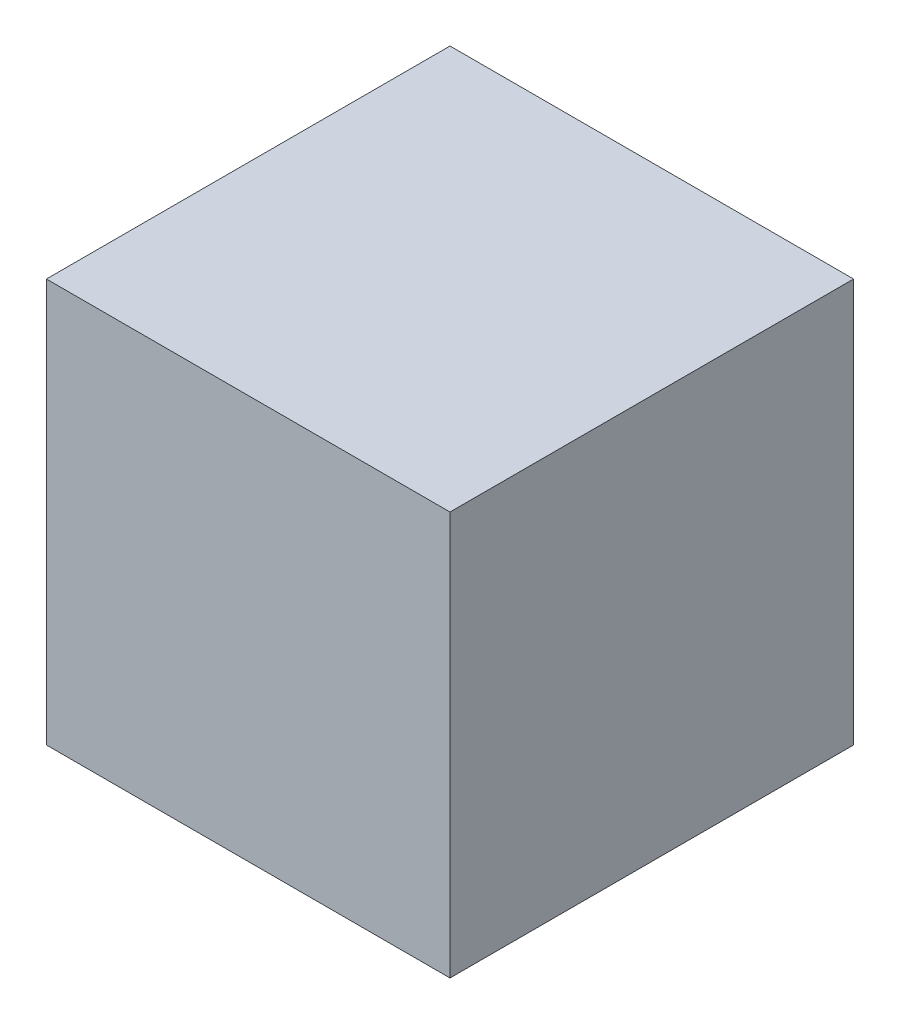
ISO-10303-21;
HEADER;
FILE_DESCRIPTION(('STEP AP214'),'2;1');
FILE_NAME('part.step','',(''),(''),'','','');
FILE_SCHEMA(('AUTOMOTIVE_DESIGN { 1 0 10303 214 1 1 1 1 }'));
ENDSEC;
DATA;
#1=APPLICATION_CONTEXT('core data for automotive mechanical design processes');
#2=APPLICATION_PROTOCOL_DEFINITION('international standard','automotive_design',2000,#1);
#3=PRODUCT_CONTEXT('',#1,'mechanical');
#4=PRODUCT('Part','Part','',(#3));
#5=PRODUCT_RELATED_PRODUCT_CATEGORY('part','',(#4));
#6=PRODUCT_DEFINITION_FORMATION('','',#4);
#7=PRODUCT_DEFINITION_CONTEXT('part definition',#1,'design');
#8=PRODUCT_DEFINITION('design','',#6,#7);
#9=PRODUCT_DEFINITION_SHAPE('','',#8);
#10=(LENGTH_UNIT() NAMED_UNIT(*) SI_UNIT(.MILLI.,.METRE.));
#11=(NAMED_UNIT(*) PLANE_ANGLE_UNIT() SI_UNIT($,.RADIAN.));
#12=(NAMED_UNIT(*) SI_UNIT($,.STERADIAN.) SOLID_ANGLE_UNIT());
#13=UNCERTAINTY_MEASURE_WITH_UNIT(LENGTH_MEASURE(1.E-05),#10,'distance_accuracy_value','');
#14=(GEOMETRIC_REPRESENTATION_CONTEXT(3) GLOBAL_UNCERTAINTY_ASSIGNED_CONTEXT((#13)) GLOBAL_UNIT_ASSIGNED_CONTEXT((#10,
#11,#12)) REPRESENTATION_CONTEXT('',''));
#15=CARTESIAN_POINT('',(0.,0.,0.));
#16=DIRECTION('',(0.,0.,1.));
#17=DIRECTION('',(1.,0.,0.));
#18=AXIS2_PLACEMENT_3D('',#15,#16,#17);
#19=CARTESIAN_POINT('',(0.,0.,700.));
#20=DIRECTION('',(1.,0.,0.));
#21=DIRECTION('',(0.,0.,-1.));
#22=AXIS2_PLACEMENT_3D('',#19,#20,#21);
#23=PLANE('',#22);
#24=DIRECTION('',(0.,-1.,0.));
#25=VECTOR('',#24,1.);
#26=CARTESIAN_POINT('',(0.,0.,0.));
#27=LINE('',#26,#25);
#28=CARTESIAN_POINT('',(0.,700.,0.));
#29=VERTEX_POINT('',#28);
#30=CARTESIAN_POINT('',(0.,0.,0.));
#31=VERTEX_POINT('',#30);
#32=EDGE_CURVE('E110',#29,#31,#27,.T.);
#33=ORIENTED_EDGE('',*,*,#32,.T.);
#34=DIRECTION('',(0.,0.,-1.));
#35=VECTOR('',#34,1.);
#36=CARTESIAN_POINT('',(0.,0.,700.));
#37=LINE('',#36,#35);
#38=CARTESIAN_POINT('',(0.,0.,700.));
#39=VERTEX_POINT('',#38);
#40=EDGE_CURVE('E11',#39,#31,#37,.T.);
#41=ORIENTED_EDGE('',*,*,#40,.F.);
#42=DIRECTION('',(0.,-1.,0.));
#43=VECTOR('',#42,1.);
#44=CARTESIAN_POINT('',(0.,0.,700.));
#45=LINE('',#44,#43);
#46=CARTESIAN_POINT('',(0.,700.,700.));
#47=VERTEX_POINT('',#46);
#48=EDGE_CURVE('E98',#47,#39,#45,.T.);
#49=ORIENTED_EDGE('',*,*,#48,.F.);
#50=DIRECTION('',(0.,0.,-1.));
#51=VECTOR('',#50,1.);
#52=CARTESIAN_POINT('',(0.,700.,700.));
#53=LINE('',#52,#51);
#54=EDGE_CURVE('E106',#47,#29,#53,.T.);
#55=ORIENTED_EDGE('',*,*,#54,.T.);
#56=EDGE_LOOP('',(#33,#41,#49,#55));
#57=FACE_BOUND('',#56,.T.);
#58=ADVANCED_FACE('F47',(#57),#23,.F.);
#59=CARTESIAN_POINT('',(0.,0.,700.));
#60=DIRECTION('',(0.,1.,0.));
#61=DIRECTION('',(0.,0.,1.));
#62=AXIS2_PLACEMENT_3D('',#59,#60,#61);
#63=PLANE('',#62);
#64=DIRECTION('',(1.,0.,0.));
#65=VECTOR('',#64,1.);
#66=CARTESIAN_POINT('',(0.,0.,0.));
#67=LINE('',#66,#65);
#68=CARTESIAN_POINT('',(700.,0.,0.));
#69=VERTEX_POINT('',#68);
#70=EDGE_CURVE('E102',#31,#69,#67,.T.);
#71=ORIENTED_EDGE('',*,*,#70,.T.);
#72=DIRECTION('',(0.,0.,-1.));
#73=VECTOR('',#72,1.);
#74=CARTESIAN_POINT('',(700.,0.,700.));
#75=LINE('',#74,#73);
#76=CARTESIAN_POINT('',(700.,0.,700.));
#77=VERTEX_POINT('',#76);
#78=EDGE_CURVE('E55',#77,#69,#75,.T.);
#79=ORIENTED_EDGE('',*,*,#78,.F.);
#80=DIRECTION('',(1.,0.,0.));
#81=VECTOR('',#80,1.);
#82=CARTESIAN_POINT('',(0.,0.,700.));
#83=LINE('',#82,#81);
#84=EDGE_CURVE('E93',#39,#77,#83,.T.);
#85=ORIENTED_EDGE('',*,*,#84,.F.);
#86=ORIENTED_EDGE('',*,*,#40,.T.);
#87=EDGE_LOOP('',(#71,#79,#85,#86));
#88=FACE_BOUND('',#87,.T.);
#89=ADVANCED_FACE('F101',(#88),#63,.F.);
#90=CARTESIAN_POINT('',(700.,0.,700.));
#91=DIRECTION('',(-1.,0.,0.));
#92=DIRECTION('',(0.,0.,1.));
#93=AXIS2_PLACEMENT_3D('',#90,#91,#92);
#94=PLANE('',#93);
#95=DIRECTION('',(0.,1.,0.));
#96=VECTOR('',#95,1.);
#97=CARTESIAN_POINT('',(700.,0.,0.));
#98=LINE('',#97,#96);
#99=CARTESIAN_POINT('',(700.,700.,0.));
#100=VERTEX_POINT('',#99);
#101=EDGE_CURVE('E80',#69,#100,#98,.T.);
#102=ORIENTED_EDGE('',*,*,#101,.T.);
#103=DIRECTION('',(0.,0.,-1.));
#104=VECTOR('',#103,1.);
#105=CARTESIAN_POINT('',(700.,700.,700.));
#106=LINE('',#105,#104);
#107=CARTESIAN_POINT('',(700.,700.,700.));
#108=VERTEX_POINT('',#107);
#109=EDGE_CURVE('E103',#108,#100,#106,.T.);
#110=ORIENTED_EDGE('',*,*,#109,.F.);
#111=DIRECTION('',(0.,1.,0.));
#112=VECTOR('',#111,1.);
#113=CARTESIAN_POINT('',(700.,0.,700.));
#114=LINE('',#113,#112);
#115=EDGE_CURVE('E96',#77,#108,#114,.T.);
#116=ORIENTED_EDGE('',*,*,#115,.F.);
#117=ORIENTED_EDGE('',*,*,#78,.T.);
#118=EDGE_LOOP('',(#102,#110,#116,#117));
#119=FACE_BOUND('',#118,.T.);
#120=ADVANCED_FACE('F104',(#119),#94,.F.);
#121=CARTESIAN_POINT('',(0.,700.,700.));
#122=DIRECTION('',(0.,-1.,0.));
#123=DIRECTION('',(0.,0.,-1.));
#124=AXIS2_PLACEMENT_3D('',#121,#122,#123);
#125=PLANE('',#124);
#126=DIRECTION('',(-1.,0.,0.));
#127=VECTOR('',#126,1.);
#128=CARTESIAN_POINT('',(0.,700.,0.));
#129=LINE('',#128,#127);
#130=EDGE_CURVE('E86',#100,#29,#129,.T.);
#131=ORIENTED_EDGE('',*,*,#130,.T.);
#132=ORIENTED_EDGE('',*,*,#54,.F.);
#133=DIRECTION('',(-1.,0.,0.));
#134=VECTOR('',#133,1.);
#135=CARTESIAN_POINT('',(0.,700.,700.));
#136=LINE('',#135,#134);
#137=EDGE_CURVE('E63',#108,#47,#136,.T.);
#138=ORIENTED_EDGE('',*,*,#137,.F.);
#139=ORIENTED_EDGE('',*,*,#109,.T.);
#140=EDGE_LOOP('',(#131,#132,#138,#139));
#141=FACE_BOUND('',#140,.T.);
#142=ADVANCED_FACE('F117',(#141),#125,.F.);
#143=CARTESIAN_POINT('',(0.,0.,700.));
#144=DIRECTION('',(0.,0.,-1.));
#145=DIRECTION('',(-1.,0.,0.));
#146=AXIS2_PLACEMENT_3D('',#143,#144,#145);
#147=PLANE('',#146);
#148=ORIENTED_EDGE('',*,*,#48,.T.);
#149=ORIENTED_EDGE('',*,*,#84,.T.);
#150=ORIENTED_EDGE('',*,*,#115,.T.);
#151=ORIENTED_EDGE('',*,*,#137,.T.);
#152=EDGE_LOOP('',(#148,#149,#150,#151));
#153=FACE_BOUND('',#152,.T.);
#154=ADVANCED_FACE('F94',(#153),#147,.F.);
#155=CARTESIAN_POINT('',(0.,0.,0.));
#156=DIRECTION('',(0.,0.,-1.));
#157=DIRECTION('',(-1.,0.,0.));
#158=AXIS2_PLACEMENT_3D('',#155,#156,#157);
#159=PLANE('',#158);
#160=ORIENTED_EDGE('',*,*,#32,.F.);
#161=ORIENTED_EDGE('',*,*,#130,.F.);
#162=ORIENTED_EDGE('',*,*,#101,.F.);
#163=ORIENTED_EDGE('',*,*,#70,.F.);
#164=EDGE_LOOP('',(#160,#161,#162,#163));
#165=FACE_BOUND('',#164,.T.);
#166=ADVANCED_FACE('F120',(#165),#159,.T.);
#167=CLOSED_SHELL('',(#58,#89,#120,#142,#154,#166));
#168=MANIFOLD_SOLID_BREP('B2',#167);
#169=ADVANCED_BREP_SHAPE_REPRESENTATION('',(#18,#168),#14);
#170=SHAPE_DEFINITION_REPRESENTATION(#9,#169);
ENDSEC;
END-ISO-10303-21;
